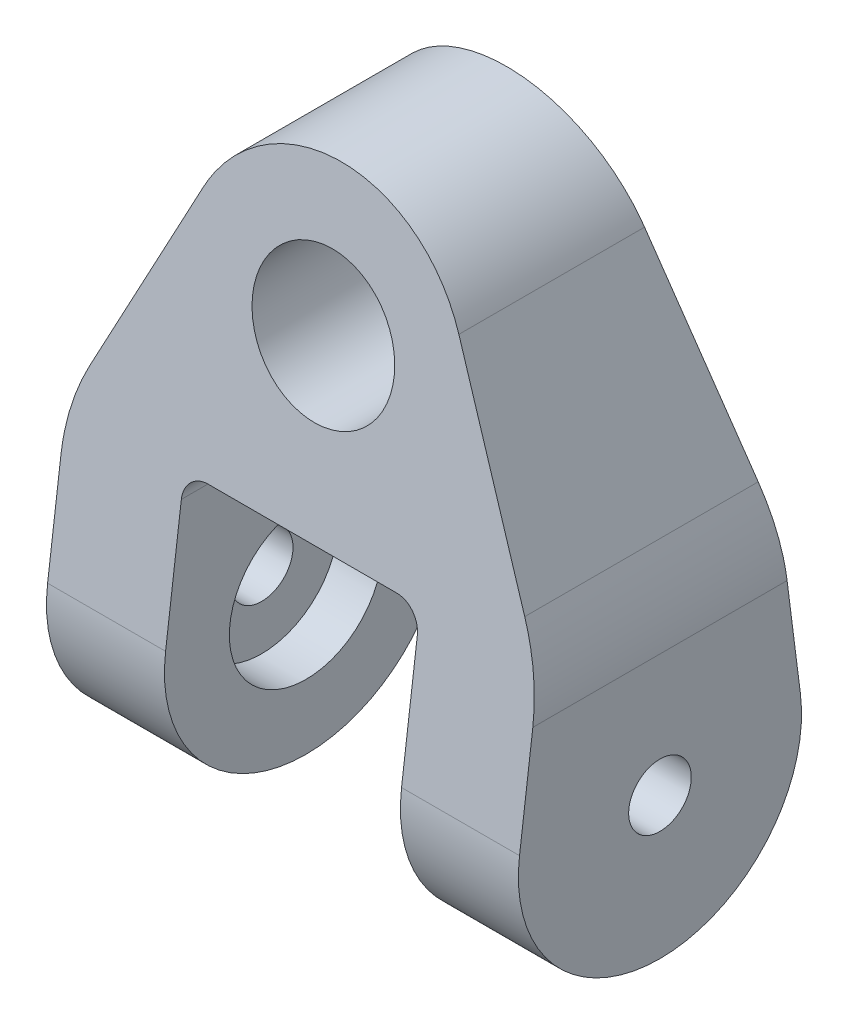
ISO-10303-21;
HEADER;
FILE_DESCRIPTION(('STEP AP214'),'2;1');
FILE_NAME('part.step','',(''),(''),'','','');
FILE_SCHEMA(('AUTOMOTIVE_DESIGN { 1 0 10303 214 1 1 1 1 }'));
ENDSEC;
DATA;
#1=APPLICATION_CONTEXT('core data for automotive mechanical design processes');
#2=APPLICATION_PROTOCOL_DEFINITION('international standard','automotive_design',2000,#1);
#3=PRODUCT_CONTEXT('',#1,'mechanical');
#4=PRODUCT('Part','Part','',(#3));
#5=PRODUCT_RELATED_PRODUCT_CATEGORY('part','',(#4));
#6=PRODUCT_DEFINITION_FORMATION('','',#4);
#7=PRODUCT_DEFINITION_CONTEXT('part definition',#1,'design');
#8=PRODUCT_DEFINITION('design','',#6,#7);
#9=PRODUCT_DEFINITION_SHAPE('','',#8);
#10=(LENGTH_UNIT() NAMED_UNIT(*) SI_UNIT(.MILLI.,.METRE.));
#11=(NAMED_UNIT(*) PLANE_ANGLE_UNIT() SI_UNIT($,.RADIAN.));
#12=(NAMED_UNIT(*) SI_UNIT($,.STERADIAN.) SOLID_ANGLE_UNIT());
#13=UNCERTAINTY_MEASURE_WITH_UNIT(LENGTH_MEASURE(1.E-05),#10,'distance_accuracy_value','');
#14=(GEOMETRIC_REPRESENTATION_CONTEXT(3) GLOBAL_UNCERTAINTY_ASSIGNED_CONTEXT((#13)) GLOBAL_UNIT_ASSIGNED_CONTEXT((#10,
#11,#12)) REPRESENTATION_CONTEXT('',''));
#15=CARTESIAN_POINT('',(0.,0.,0.));
#16=DIRECTION('',(0.,0.,1.));
#17=DIRECTION('',(1.,0.,0.));
#18=AXIS2_PLACEMENT_3D('',#15,#16,#17);
#19=CARTESIAN_POINT('',(0.,0.,19.05));
#20=DIRECTION('',(0.,0.,-1.));
#21=DIRECTION('',(-1.,0.,0.));
#22=AXIS2_PLACEMENT_3D('',#19,#20,#21);
#23=CYLINDRICAL_SURFACE('',#22,9.525);
#24=CARTESIAN_POINT('',(0.,0.,-13.539961345954));
#25=DIRECTION('',(0.,0.126403695343971,-0.991978883748736));
#26=DIRECTION('',(0.,-0.991978883748736,-0.126403695343971));
#27=AXIS2_PLACEMENT_3D('',#24,#25,#26);
#28=ELLIPSE('',#27,9.60201890992333,9.525);
#29=CARTESIAN_POINT('',(0.,-9.525,-14.753692018931));
#30=VERTEX_POINT('',#29);
#31=EDGE_CURVE('E183',#30,#30,#28,.T.);
#32=ORIENTED_EDGE('',*,*,#31,.T.);
#33=EDGE_LOOP('',(#32));
#34=FACE_BOUND('',#33,.T.);
#35=CARTESIAN_POINT('',(0.,0.,13.539961345954));
#36=DIRECTION('',(0.,0.126403695343971,0.991978883748736));
#37=DIRECTION('',(0.,0.991978883748736,-0.126403695343971));
#38=AXIS2_PLACEMENT_3D('',#35,#36,#37);
#39=ELLIPSE('',#38,9.60201890992333,9.525);
#40=CARTESIAN_POINT('',(0.,9.525,12.326230672977));
#41=VERTEX_POINT('',#40);
#42=EDGE_CURVE('E199',#41,#41,#39,.T.);
#43=ORIENTED_EDGE('',*,*,#42,.T.);
#44=EDGE_LOOP('',(#43));
#45=FACE_BOUND('',#44,.T.);
#46=ADVANCED_FACE('F46',(#34,#45),#23,.F.);
#47=CARTESIAN_POINT('',(-31.75,-44.45,0.));
#48=DIRECTION('',(1.,0.,0.));
#49=DIRECTION('',(0.,0.,-1.));
#50=AXIS2_PLACEMENT_3D('',#47,#48,#49);
#51=CYLINDRICAL_SURFACE('',#50,19.05);
#52=DIRECTION('',(1.,0.,0.));
#53=VECTOR('',#52,1.);
#54=CARTESIAN_POINT('',(-31.75,-42.0420096036973,18.8971977354134));
#55=LINE('',#54,#53);
#56=CARTESIAN_POINT('',(-31.75,-42.0420096036973,18.8971977354134));
#57=VERTEX_POINT('',#56);
#58=CARTESIAN_POINT('',(-15.875,-42.0420096036973,18.8971977354134));
#59=VERTEX_POINT('',#58);
#60=EDGE_CURVE('E153',#57,#59,#55,.T.);
#61=ORIENTED_EDGE('',*,*,#60,.F.);
#62=CARTESIAN_POINT('',(-31.75,-44.45,0.));
#63=DIRECTION('',(1.,0.,0.));
#64=DIRECTION('',(0.,0.,-1.));
#65=AXIS2_PLACEMENT_3D('',#62,#63,#64);
#66=CIRCLE('',#65,19.05);
#67=CARTESIAN_POINT('',(-31.75,-42.0420096036973,-18.8971977354134));
#68=VERTEX_POINT('',#67);
#69=EDGE_CURVE('E147',#57,#68,#66,.T.);
#70=ORIENTED_EDGE('',*,*,#69,.T.);
#71=DIRECTION('',(1.,0.,0.));
#72=VECTOR('',#71,1.);
#73=CARTESIAN_POINT('',(-31.75,-42.0420096036973,-18.8971977354134));
#74=LINE('',#73,#72);
#75=CARTESIAN_POINT('',(-15.875,-42.0420096036973,-18.8971977354134));
#76=VERTEX_POINT('',#75);
#77=EDGE_CURVE('E150',#68,#76,#74,.T.);
#78=ORIENTED_EDGE('',*,*,#77,.T.);
#79=CARTESIAN_POINT('',(-15.875,-44.45,0.));
#80=DIRECTION('',(-1.,0.,0.));
#81=DIRECTION('',(0.,0.,1.));
#82=AXIS2_PLACEMENT_3D('',#79,#80,#81);
#83=CIRCLE('',#82,19.05);
#84=EDGE_CURVE('E217',#76,#59,#83,.T.);
#85=ORIENTED_EDGE('',*,*,#84,.T.);
#86=EDGE_LOOP('',(#61,#70,#78,#85));
#87=FACE_BOUND('',#86,.T.);
#88=ADVANCED_FACE('F149',(#87),#51,.T.);
#89=CARTESIAN_POINT('',(15.875,-44.45,0.));
#90=DIRECTION('',(1.,0.,0.));
#91=DIRECTION('',(0.,0.,-1.));
#92=AXIS2_PLACEMENT_3D('',#89,#90,#91);
#93=CIRCLE('',#92,19.05);
#94=CARTESIAN_POINT('',(15.875,-42.0420096036973,18.8971977354134));
#95=VERTEX_POINT('',#94);
#96=CARTESIAN_POINT('',(15.875,-42.0420096036973,-18.8971977354134));
#97=VERTEX_POINT('',#96);
#98=EDGE_CURVE('E215',#95,#97,#93,.T.);
#99=ORIENTED_EDGE('',*,*,#98,.T.);
#100=CARTESIAN_POINT('',(31.75,-42.0420096036973,-18.8971977354134));
#101=VERTEX_POINT('',#100);
#102=EDGE_CURVE('E166',#97,#101,#74,.T.);
#103=ORIENTED_EDGE('',*,*,#102,.T.);
#104=CARTESIAN_POINT('',(31.75,-44.45,0.));
#105=DIRECTION('',(1.,0.,0.));
#106=DIRECTION('',(0.,0.,-1.));
#107=AXIS2_PLACEMENT_3D('',#104,#105,#106);
#108=CIRCLE('',#107,19.05);
#109=CARTESIAN_POINT('',(31.75,-42.0420096036973,18.8971977354134));
#110=VERTEX_POINT('',#109);
#111=EDGE_CURVE('E177',#110,#101,#108,.T.);
#112=ORIENTED_EDGE('',*,*,#111,.F.);
#113=EDGE_CURVE('E165',#95,#110,#55,.T.);
#114=ORIENTED_EDGE('',*,*,#113,.F.);
#115=EDGE_LOOP('',(#99,#103,#112,#114));
#116=FACE_BOUND('',#115,.T.);
#117=ADVANCED_FACE('F294',(#116),#51,.T.);
#118=CARTESIAN_POINT('',(-31.75,-42.0420096036973,18.8971977354134));
#119=DIRECTION('',(0.,0.126403695343971,0.991978883748736));
#120=DIRECTION('',(0.,-0.991978883748736,0.126403695343971));
#121=AXIS2_PLACEMENT_3D('',#118,#119,#120);
#122=PLANE('',#121);
#123=ORIENTED_EDGE('',*,*,#42,.F.);
#124=EDGE_LOOP('',(#123));
#125=FACE_BOUND('',#124,.T.);
#126=DIRECTION('',(-0.428730230966541,-0.896186021635441,0.11419721397923));
#127=VECTOR('',#126,1.);
#128=CARTESIAN_POINT('',(-17.5058243717781,7.54997308494896,12.5779000427148));
#129=LINE('',#128,#127);
#130=CARTESIAN_POINT('',(-17.1847647256924,8.22109246527484,12.4923821238559));
#131=VERTEX_POINT('',#130);
#132=CARTESIAN_POINT('',(-29.2630196342565,-17.0263998573498,15.7095638401521));
#133=VERTEX_POINT('',#132);
#134=EDGE_CURVE('E204',#131,#133,#129,.T.);
#135=ORIENTED_EDGE('',*,*,#134,.T.);
#136=CARTESIAN_POINT('',(-6.35,-27.9878564777162,17.1063361362828));
#137=DIRECTION('',(0.,0.126403695343971,0.991978883748736));
#138=DIRECTION('',(0.,0.991978883748736,-0.126403695343971));
#139=AXIS2_PLACEMENT_3D('',#136,#137,#138);
#140=ELLIPSE('',#139,25.6053837597955,25.4);
#141=CARTESIAN_POINT('',(-31.75,-27.9878564777162,17.1063361362828));
#142=VERTEX_POINT('',#141);
#143=EDGE_CURVE('E255',#133,#142,#140,.T.);
#144=ORIENTED_EDGE('',*,*,#143,.T.);
#145=DIRECTION('',(0.,-0.991978883748736,0.126403695343971));
#146=VECTOR('',#145,1.);
#147=CARTESIAN_POINT('',(-31.75,-42.0420096036973,18.8971977354134));
#148=LINE('',#147,#146);
#149=EDGE_CURVE('E172',#142,#57,#148,.T.);
#150=ORIENTED_EDGE('',*,*,#149,.T.);
#151=ORIENTED_EDGE('',*,*,#60,.T.);
#152=DIRECTION('',(0.,0.991978883748736,-0.126403695343971));
#153=VECTOR('',#152,1.);
#154=CARTESIAN_POINT('',(-15.875,-63.1763063446539,21.5902522452608));
#155=LINE('',#154,#153);
#156=CARTESIAN_POINT('',(-15.875,-25.4,16.7765764738927));
#157=VERTEX_POINT('',#156);
#158=EDGE_CURVE('E212',#59,#157,#155,.T.);
#159=ORIENTED_EDGE('',*,*,#158,.T.);
#160=CARTESIAN_POINT('',(-12.7,-25.4,16.7765764738927));
#161=DIRECTION('',(0.,0.126403695343971,0.991978883748736));
#162=DIRECTION('',(0.,-0.991978883748736,0.126403695343971));
#163=AXIS2_PLACEMENT_3D('',#160,#161,#162);
#164=ELLIPSE('',#163,3.20067296997444,3.175);
#165=CARTESIAN_POINT('',(-12.7,-22.225,16.3719995829003));
#166=VERTEX_POINT('',#165);
#167=EDGE_CURVE('E241',#157,#166,#164,.F.);
#168=ORIENTED_EDGE('',*,*,#167,.T.);
#169=DIRECTION('',(1.,0.,0.));
#170=VECTOR('',#169,1.);
#171=CARTESIAN_POINT('',(15.875,-22.225,16.3719995829003));
#172=LINE('',#171,#170);
#173=CARTESIAN_POINT('',(12.7,-22.225,16.3719995829003));
#174=VERTEX_POINT('',#173);
#175=EDGE_CURVE('E209',#166,#174,#172,.T.);
#176=ORIENTED_EDGE('',*,*,#175,.T.);
#177=CARTESIAN_POINT('',(12.7,-25.4,16.7765764738927));
#178=DIRECTION('',(0.,0.126403695343971,0.991978883748736));
#179=DIRECTION('',(0.,-0.991978883748736,0.126403695343971));
#180=AXIS2_PLACEMENT_3D('',#177,#178,#179);
#181=ELLIPSE('',#180,3.20067296997444,3.175);
#182=CARTESIAN_POINT('',(15.875,-25.4,16.7765764738927));
#183=VERTEX_POINT('',#182);
#184=EDGE_CURVE('E245',#174,#183,#181,.F.);
#185=ORIENTED_EDGE('',*,*,#184,.T.);
#186=DIRECTION('',(0.,-0.991978883748736,0.126403695343971));
#187=VECTOR('',#186,1.);
#188=CARTESIAN_POINT('',(15.875,-63.1763063446539,21.5902522452608));
#189=LINE('',#188,#187);
#190=EDGE_CURVE('E207',#183,#95,#189,.T.);
#191=ORIENTED_EDGE('',*,*,#190,.T.);
#192=ORIENTED_EDGE('',*,*,#113,.T.);
#193=DIRECTION('',(0.,-0.991978883748736,0.126403695343971));
#194=VECTOR('',#193,1.);
#195=CARTESIAN_POINT('',(31.75,-42.0420096036973,18.8971977354134));
#196=LINE('',#195,#194);
#197=CARTESIAN_POINT('',(31.75,-27.9878564777163,17.1063361362828));
#198=VERTEX_POINT('',#197);
#199=EDGE_CURVE('E158',#198,#110,#196,.T.);
#200=ORIENTED_EDGE('',*,*,#199,.F.);
#201=CARTESIAN_POINT('',(6.35,-27.9878564777163,17.1063361362828));
#202=DIRECTION('',(0.,0.126403695343971,0.991978883748736));
#203=DIRECTION('',(0.,0.991978883748736,-0.126403695343971));
#204=AXIS2_PLACEMENT_3D('',#201,#202,#203);
#205=ELLIPSE('',#204,25.6053837597955,25.4);
#206=CARTESIAN_POINT('',(29.2630196342565,-17.0263998573498,15.7095638401521));
#207=VERTEX_POINT('',#206);
#208=EDGE_CURVE('E61',#198,#207,#205,.T.);
#209=ORIENTED_EDGE('',*,*,#208,.T.);
#210=DIRECTION('',(-0.428730230966541,0.896186021635441,-0.11419721397923));
#211=VECTOR('',#210,1.);
#212=CARTESIAN_POINT('',(17.5058243717781,7.54997308494896,12.5779000427148));
#213=LINE('',#212,#211);
#214=CARTESIAN_POINT('',(17.1847647256924,8.22109246527484,12.4923821238559));
#215=VERTEX_POINT('',#214);
#216=EDGE_CURVE('E200',#207,#215,#213,.T.);
#217=ORIENTED_EDGE('',*,*,#216,.T.);
#218=CARTESIAN_POINT('',(0.,0.,13.539961345954));
#219=DIRECTION('',(0.,0.126403695343971,0.991978883748736));
#220=DIRECTION('',(0.,0.991978883748736,-0.126403695343971));
#221=AXIS2_PLACEMENT_3D('',#218,#219,#220);
#222=ELLIPSE('',#221,19.2040378198467,19.05);
#223=EDGE_CURVE('E202',#215,#131,#222,.T.);
#224=ORIENTED_EDGE('',*,*,#223,.T.);
#225=EDGE_LOOP('',(#135,#144,#150,#151,#159,#168,#176,#185,#191,#192,#200,#209,#217,#224));
#226=FACE_BOUND('',#225,.T.);
#227=ADVANCED_FACE('F275',(#125,#226),#122,.T.);
#228=CARTESIAN_POINT('',(-31.75,-42.0420096036973,-18.8971977354134));
#229=DIRECTION('',(0.,0.126403695343971,-0.991978883748736));
#230=DIRECTION('',(0.,0.991978883748736,0.126403695343971));
#231=AXIS2_PLACEMENT_3D('',#228,#229,#230);
#232=PLANE('',#231);
#233=ORIENTED_EDGE('',*,*,#31,.F.);
#234=EDGE_LOOP('',(#233));
#235=FACE_BOUND('',#234,.T.);
#236=DIRECTION('',(0.,0.991978883748736,0.126403695343971));
#237=VECTOR('',#236,1.);
#238=CARTESIAN_POINT('',(-31.75,-42.0420096036973,-18.8971977354134));
#239=LINE('',#238,#237);
#240=CARTESIAN_POINT('',(-31.75,-27.9878564777163,-17.1063361362828));
#241=VERTEX_POINT('',#240);
#242=EDGE_CURVE('E157',#68,#241,#239,.T.);
#243=ORIENTED_EDGE('',*,*,#242,.T.);
#244=CARTESIAN_POINT('',(-6.35,-27.9878564777162,-17.1063361362828));
#245=DIRECTION('',(0.,0.126403695343971,-0.991978883748736));
#246=DIRECTION('',(0.,-0.991978883748736,-0.126403695343971));
#247=AXIS2_PLACEMENT_3D('',#244,#245,#246);
#248=ELLIPSE('',#247,25.6053837597955,25.4);
#249=CARTESIAN_POINT('',(-29.2630196342565,-17.0263998573498,-15.7095638401521));
#250=VERTEX_POINT('',#249);
#251=EDGE_CURVE('E250',#241,#250,#248,.T.);
#252=ORIENTED_EDGE('',*,*,#251,.T.);
#253=DIRECTION('',(0.428730230966541,0.896186021635441,0.11419721397923));
#254=VECTOR('',#253,1.);
#255=CARTESIAN_POINT('',(-15.6404560708337,11.4492012609968,-12.0810378024833));
#256=LINE('',#255,#254);
#257=CARTESIAN_POINT('',(-17.1847647256924,8.22109246527484,-12.4923821238559));
#258=VERTEX_POINT('',#257);
#259=EDGE_CURVE('E190',#250,#258,#256,.T.);
#260=ORIENTED_EDGE('',*,*,#259,.T.);
#261=CARTESIAN_POINT('',(0.,0.,-13.539961345954));
#262=DIRECTION('',(0.,0.126403695343971,-0.991978883748736));
#263=DIRECTION('',(0.,-0.991978883748736,-0.126403695343971));
#264=AXIS2_PLACEMENT_3D('',#261,#262,#263);
#265=ELLIPSE('',#264,19.2040378198467,19.05);
#266=CARTESIAN_POINT('',(17.1847647256924,8.22109246527484,-12.4923821238559));
#267=VERTEX_POINT('',#266);
#268=EDGE_CURVE('E188',#258,#267,#265,.T.);
#269=ORIENTED_EDGE('',*,*,#268,.T.);
#270=DIRECTION('',(0.428730230966541,-0.896186021635441,-0.11419721397923));
#271=VECTOR('',#270,1.);
#272=CARTESIAN_POINT('',(15.6404560708337,11.4492012609968,-12.0810378024833));
#273=LINE('',#272,#271);
#274=CARTESIAN_POINT('',(29.2630196342565,-17.0263998573498,-15.7095638401521));
#275=VERTEX_POINT('',#274);
#276=EDGE_CURVE('E185',#267,#275,#273,.T.);
#277=ORIENTED_EDGE('',*,*,#276,.T.);
#278=CARTESIAN_POINT('',(6.35,-27.9878564777163,-17.1063361362828));
#279=DIRECTION('',(0.,0.126403695343971,-0.991978883748736));
#280=DIRECTION('',(0.,-0.991978883748736,-0.126403695343971));
#281=AXIS2_PLACEMENT_3D('',#278,#279,#280);
#282=ELLIPSE('',#281,25.6053837597955,25.4);
#283=CARTESIAN_POINT('',(31.75,-27.9878564777163,-17.1063361362828));
#284=VERTEX_POINT('',#283);
#285=EDGE_CURVE('E248',#275,#284,#282,.T.);
#286=ORIENTED_EDGE('',*,*,#285,.T.);
#287=DIRECTION('',(0.,0.991978883748736,0.126403695343971));
#288=VECTOR('',#287,1.);
#289=CARTESIAN_POINT('',(31.75,-42.0420096036973,-18.8971977354134));
#290=LINE('',#289,#288);
#291=EDGE_CURVE('E179',#101,#284,#290,.T.);
#292=ORIENTED_EDGE('',*,*,#291,.F.);
#293=ORIENTED_EDGE('',*,*,#102,.F.);
#294=DIRECTION('',(0.,0.991978883748736,0.126403695343971));
#295=VECTOR('',#294,1.);
#296=CARTESIAN_POINT('',(15.875,-58.3989550938499,-20.98149447637));
#297=LINE('',#296,#295);
#298=CARTESIAN_POINT('',(15.875,-25.4,-16.7765764738927));
#299=VERTEX_POINT('',#298);
#300=EDGE_CURVE('E192',#97,#299,#297,.T.);
#301=ORIENTED_EDGE('',*,*,#300,.T.);
#302=CARTESIAN_POINT('',(12.7,-25.4,-16.7765764738927));
#303=DIRECTION('',(0.,0.126403695343971,-0.991978883748736));
#304=DIRECTION('',(0.,0.991978883748736,0.126403695343971));
#305=AXIS2_PLACEMENT_3D('',#302,#303,#304);
#306=ELLIPSE('',#305,3.20067296997444,3.175);
#307=CARTESIAN_POINT('',(12.7,-22.225,-16.3719995829003));
#308=VERTEX_POINT('',#307);
#309=EDGE_CURVE('E243',#299,#308,#306,.F.);
#310=ORIENTED_EDGE('',*,*,#309,.T.);
#311=DIRECTION('',(-1.,0.,0.));
#312=VECTOR('',#311,1.);
#313=CARTESIAN_POINT('',(15.875,-22.225,-16.3719995829003));
#314=LINE('',#313,#312);
#315=CARTESIAN_POINT('',(-12.7,-22.225,-16.3719995829003));
#316=VERTEX_POINT('',#315);
#317=EDGE_CURVE('E195',#308,#316,#314,.T.);
#318=ORIENTED_EDGE('',*,*,#317,.T.);
#319=CARTESIAN_POINT('',(-12.7,-25.4,-16.7765764738927));
#320=DIRECTION('',(0.,0.126403695343971,-0.991978883748736));
#321=DIRECTION('',(0.,0.991978883748736,0.126403695343971));
#322=AXIS2_PLACEMENT_3D('',#319,#320,#321);
#323=ELLIPSE('',#322,3.20067296997444,3.175);
#324=CARTESIAN_POINT('',(-15.875,-25.4,-16.7765764738927));
#325=VERTEX_POINT('',#324);
#326=EDGE_CURVE('E239',#316,#325,#323,.F.);
#327=ORIENTED_EDGE('',*,*,#326,.T.);
#328=DIRECTION('',(0.,-0.991978883748736,-0.126403695343971));
#329=VECTOR('',#328,1.);
#330=CARTESIAN_POINT('',(-15.875,-58.3989550938499,-20.98149447637));
#331=LINE('',#330,#329);
#332=EDGE_CURVE('E164',#325,#76,#331,.T.);
#333=ORIENTED_EDGE('',*,*,#332,.T.);
#334=ORIENTED_EDGE('',*,*,#77,.F.);
#335=EDGE_LOOP('',(#243,#252,#260,#269,#277,#286,#292,#293,#301,#310,#318,#327,#333,#334));
#336=FACE_BOUND('',#335,.T.);
#337=ADVANCED_FACE('F162',(#235,#336),#232,.T.);
#338=CARTESIAN_POINT('',(-31.75,-22.225,19.05));
#339=DIRECTION('',(1.,0.,0.));
#340=DIRECTION('',(0.,0.,-1.));
#341=AXIS2_PLACEMENT_3D('',#338,#339,#340);
#342=PLANE('',#341);
#343=CARTESIAN_POINT('',(-31.75,-44.45,0.));
#344=DIRECTION('',(1.,0.,0.));
#345=DIRECTION('',(0.,0.,-1.));
#346=AXIS2_PLACEMENT_3D('',#343,#344,#345);
#347=CIRCLE('',#346,4.21639999999999);
#348=CARTESIAN_POINT('',(-31.75,-44.45,-4.2164));
#349=VERTEX_POINT('',#348);
#350=EDGE_CURVE('E180',#349,#349,#347,.T.);
#351=ORIENTED_EDGE('',*,*,#350,.T.);
#352=EDGE_LOOP('',(#351));
#353=FACE_BOUND('',#352,.T.);
#354=ORIENTED_EDGE('',*,*,#149,.F.);
#355=DIRECTION('',(0.,0.,-1.));
#356=VECTOR('',#355,1.);
#357=CARTESIAN_POINT('',(-31.75,-27.9878564777162,19.05));
#358=LINE('',#357,#356);
#359=EDGE_CURVE('E171',#142,#241,#358,.T.);
#360=ORIENTED_EDGE('',*,*,#359,.T.);
#361=ORIENTED_EDGE('',*,*,#242,.F.);
#362=ORIENTED_EDGE('',*,*,#69,.F.);
#363=EDGE_LOOP('',(#354,#360,#361,#362));
#364=FACE_BOUND('',#363,.T.);
#365=ADVANCED_FACE('F169',(#353,#364),#342,.F.);
#366=CARTESIAN_POINT('',(-17.1847647256924,8.22109246527484,19.05));
#367=DIRECTION('',(0.902087387175453,-0.431553410250648,0.));
#368=DIRECTION('',(0.431553410250648,0.902087387175453,0.));
#369=AXIS2_PLACEMENT_3D('',#366,#367,#368);
#370=PLANE('',#369);
#371=ORIENTED_EDGE('',*,*,#259,.F.);
#372=DIRECTION('',(0.,0.,-1.));
#373=VECTOR('',#372,1.);
#374=CARTESIAN_POINT('',(-29.2630196342565,-17.0263998573498,19.05));
#375=LINE('',#374,#373);
#376=EDGE_CURVE('E252',#250,#133,#375,.F.);
#377=ORIENTED_EDGE('',*,*,#376,.T.);
#378=ORIENTED_EDGE('',*,*,#134,.F.);
#379=DIRECTION('',(0.,0.,-1.));
#380=VECTOR('',#379,1.);
#381=CARTESIAN_POINT('',(-17.1847647256924,8.22109246527484,19.05));
#382=LINE('',#381,#380);
#383=EDGE_CURVE('E222',#131,#258,#382,.T.);
#384=ORIENTED_EDGE('',*,*,#383,.T.);
#385=EDGE_LOOP('',(#371,#377,#378,#384));
#386=FACE_BOUND('',#385,.T.);
#387=ADVANCED_FACE('F272',(#386),#370,.F.);
#388=CARTESIAN_POINT('',(17.1847647256924,8.22109246527484,19.05));
#389=DIRECTION('',(-0.902087387175453,-0.431553410250648,0.));
#390=DIRECTION('',(0.431553410250648,-0.902087387175453,0.));
#391=AXIS2_PLACEMENT_3D('',#388,#389,#390);
#392=PLANE('',#391);
#393=ORIENTED_EDGE('',*,*,#216,.F.);
#394=DIRECTION('',(0.,0.,-1.));
#395=VECTOR('',#394,1.);
#396=CARTESIAN_POINT('',(29.2630196342565,-17.0263998573498,19.05));
#397=LINE('',#396,#395);
#398=EDGE_CURVE('E54',#207,#275,#397,.T.);
#399=ORIENTED_EDGE('',*,*,#398,.T.);
#400=ORIENTED_EDGE('',*,*,#276,.F.);
#401=DIRECTION('',(0.,0.,-1.));
#402=VECTOR('',#401,1.);
#403=CARTESIAN_POINT('',(17.1847647256924,8.22109246527484,19.05));
#404=LINE('',#403,#402);
#405=EDGE_CURVE('E219',#215,#267,#404,.T.);
#406=ORIENTED_EDGE('',*,*,#405,.F.);
#407=EDGE_LOOP('',(#393,#399,#400,#406));
#408=FACE_BOUND('',#407,.T.);
#409=ADVANCED_FACE('F260',(#408),#392,.F.);
#410=CARTESIAN_POINT('',(31.75,-22.225,19.05));
#411=DIRECTION('',(-1.,0.,0.));
#412=DIRECTION('',(0.,0.,1.));
#413=AXIS2_PLACEMENT_3D('',#410,#411,#412);
#414=PLANE('',#413);
#415=CARTESIAN_POINT('',(31.75,-44.45,0.));
#416=DIRECTION('',(-1.,0.,0.));
#417=DIRECTION('',(0.,0.,1.));
#418=AXIS2_PLACEMENT_3D('',#415,#416,#417);
#419=CIRCLE('',#418,4.21639999999999);
#420=CARTESIAN_POINT('',(31.75,-44.45,4.21639999999999));
#421=VERTEX_POINT('',#420);
#422=EDGE_CURVE('E397',#421,#421,#419,.T.);
#423=ORIENTED_EDGE('',*,*,#422,.T.);
#424=EDGE_LOOP('',(#423));
#425=FACE_BOUND('',#424,.T.);
#426=ORIENTED_EDGE('',*,*,#291,.T.);
#427=DIRECTION('',(0.,0.,-1.));
#428=VECTOR('',#427,1.);
#429=CARTESIAN_POINT('',(31.75,-27.9878564777163,19.05));
#430=LINE('',#429,#428);
#431=EDGE_CURVE('E14',#284,#198,#430,.F.);
#432=ORIENTED_EDGE('',*,*,#431,.T.);
#433=ORIENTED_EDGE('',*,*,#199,.T.);
#434=ORIENTED_EDGE('',*,*,#111,.T.);
#435=EDGE_LOOP('',(#426,#432,#433,#434));
#436=FACE_BOUND('',#435,.T.);
#437=ADVANCED_FACE('F301',(#425,#436),#414,.F.);
#438=CARTESIAN_POINT('',(0.,0.,19.05));
#439=DIRECTION('',(0.,0.,-1.));
#440=DIRECTION('',(-1.,0.,0.));
#441=AXIS2_PLACEMENT_3D('',#438,#439,#440);
#442=CYLINDRICAL_SURFACE('',#441,19.05);
#443=ORIENTED_EDGE('',*,*,#223,.F.);
#444=ORIENTED_EDGE('',*,*,#405,.T.);
#445=ORIENTED_EDGE('',*,*,#268,.F.);
#446=ORIENTED_EDGE('',*,*,#383,.F.);
#447=EDGE_LOOP('',(#443,#444,#445,#446));
#448=FACE_BOUND('',#447,.T.);
#449=ADVANCED_FACE('F269',(#448),#442,.T.);
#450=CARTESIAN_POINT('',(-15.875,-63.5,19.05));
#451=DIRECTION('',(-1.,0.,0.));
#452=DIRECTION('',(0.,0.,1.));
#453=AXIS2_PLACEMENT_3D('',#450,#451,#452);
#454=PLANE('',#453);
#455=CARTESIAN_POINT('',(-15.875,-44.45,0.));
#456=DIRECTION('',(1.,0.,0.));
#457=DIRECTION('',(0.,0.,-1.));
#458=AXIS2_PLACEMENT_3D('',#455,#456,#457);
#459=CIRCLE('',#458,10.31875);
#460=CARTESIAN_POINT('',(-15.875,-44.45,-10.31875));
#461=VERTEX_POINT('',#460);
#462=EDGE_CURVE('E400',#461,#461,#459,.T.);
#463=ORIENTED_EDGE('',*,*,#462,.F.);
#464=EDGE_LOOP('',(#463));
#465=FACE_BOUND('',#464,.T.);
#466=ORIENTED_EDGE('',*,*,#332,.F.);
#467=DIRECTION('',(0.,0.,-1.));
#468=VECTOR('',#467,1.);
#469=CARTESIAN_POINT('',(-15.875,-25.4,16.3719995829003));
#470=LINE('',#469,#468);
#471=EDGE_CURVE('E234',#325,#157,#470,.F.);
#472=ORIENTED_EDGE('',*,*,#471,.T.);
#473=ORIENTED_EDGE('',*,*,#158,.F.);
#474=ORIENTED_EDGE('',*,*,#84,.F.);
#475=EDGE_LOOP('',(#466,#472,#473,#474));
#476=FACE_BOUND('',#475,.T.);
#477=ADVANCED_FACE('F312',(#465,#476),#454,.F.);
#478=CARTESIAN_POINT('',(15.875,-22.225,19.05));
#479=DIRECTION('',(0.,1.,0.));
#480=DIRECTION('',(-1.,0.,0.));
#481=AXIS2_PLACEMENT_3D('',#478,#479,#480);
#482=PLANE('',#481);
#483=ORIENTED_EDGE('',*,*,#175,.F.);
#484=DIRECTION('',(0.,0.,-1.));
#485=VECTOR('',#484,1.);
#486=CARTESIAN_POINT('',(-12.7,-22.225,-16.3719995829003));
#487=LINE('',#486,#485);
#488=EDGE_CURVE('E231',#166,#316,#487,.T.);
#489=ORIENTED_EDGE('',*,*,#488,.T.);
#490=ORIENTED_EDGE('',*,*,#317,.F.);
#491=DIRECTION('',(0.,0.,-1.));
#492=VECTOR('',#491,1.);
#493=CARTESIAN_POINT('',(12.7,-22.225,16.3719995829003));
#494=LINE('',#493,#492);
#495=EDGE_CURVE('E225',#308,#174,#494,.F.);
#496=ORIENTED_EDGE('',*,*,#495,.T.);
#497=EDGE_LOOP('',(#483,#489,#490,#496));
#498=FACE_BOUND('',#497,.T.);
#499=ADVANCED_FACE('F308',(#498),#482,.F.);
#500=CARTESIAN_POINT('',(15.875,-63.5,19.05));
#501=DIRECTION('',(1.,0.,0.));
#502=DIRECTION('',(0.,0.,-1.));
#503=AXIS2_PLACEMENT_3D('',#500,#501,#502);
#504=PLANE('',#503);
#505=CARTESIAN_POINT('',(15.875,-44.45,0.));
#506=DIRECTION('',(-1.,0.,0.));
#507=DIRECTION('',(0.,0.,1.));
#508=AXIS2_PLACEMENT_3D('',#505,#506,#507);
#509=CIRCLE('',#508,10.31875);
#510=CARTESIAN_POINT('',(15.875,-44.45,10.31875));
#511=VERTEX_POINT('',#510);
#512=EDGE_CURVE('E390',#511,#511,#509,.T.);
#513=ORIENTED_EDGE('',*,*,#512,.F.);
#514=EDGE_LOOP('',(#513));
#515=FACE_BOUND('',#514,.T.);
#516=ORIENTED_EDGE('',*,*,#190,.F.);
#517=DIRECTION('',(0.,0.,-1.));
#518=VECTOR('',#517,1.);
#519=CARTESIAN_POINT('',(15.875,-25.4,-16.3719995829003));
#520=LINE('',#519,#518);
#521=EDGE_CURVE('E236',#183,#299,#520,.T.);
#522=ORIENTED_EDGE('',*,*,#521,.T.);
#523=ORIENTED_EDGE('',*,*,#300,.F.);
#524=ORIENTED_EDGE('',*,*,#98,.F.);
#525=EDGE_LOOP('',(#516,#522,#523,#524));
#526=FACE_BOUND('',#525,.T.);
#527=ADVANCED_FACE('F305',(#515,#526),#504,.F.);
#528=CARTESIAN_POINT('',(-12.7,-25.4,19.05));
#529=DIRECTION('',(0.,0.,1.));
#530=DIRECTION('',(1.,0.,0.));
#531=AXIS2_PLACEMENT_3D('',#528,#529,#530);
#532=CYLINDRICAL_SURFACE('',#531,3.175);
#533=ORIENTED_EDGE('',*,*,#167,.F.);
#534=ORIENTED_EDGE('',*,*,#471,.F.);
#535=ORIENTED_EDGE('',*,*,#326,.F.);
#536=ORIENTED_EDGE('',*,*,#488,.F.);
#537=EDGE_LOOP('',(#533,#534,#535,#536));
#538=FACE_BOUND('',#537,.T.);
#539=ADVANCED_FACE('F285',(#538),#532,.F.);
#540=CARTESIAN_POINT('',(12.7,-25.4,19.05));
#541=DIRECTION('',(0.,0.,1.));
#542=DIRECTION('',(1.,0.,0.));
#543=AXIS2_PLACEMENT_3D('',#540,#541,#542);
#544=CYLINDRICAL_SURFACE('',#543,3.175);
#545=ORIENTED_EDGE('',*,*,#184,.F.);
#546=ORIENTED_EDGE('',*,*,#495,.F.);
#547=ORIENTED_EDGE('',*,*,#309,.F.);
#548=ORIENTED_EDGE('',*,*,#521,.F.);
#549=EDGE_LOOP('',(#545,#546,#547,#548));
#550=FACE_BOUND('',#549,.T.);
#551=ADVANCED_FACE('F279',(#550),#544,.F.);
#552=CARTESIAN_POINT('',(-6.35,-27.9878564777162,19.05));
#553=DIRECTION('',(0.,0.,-1.));
#554=DIRECTION('',(-1.,0.,0.));
#555=AXIS2_PLACEMENT_3D('',#552,#553,#554);
#556=CYLINDRICAL_SURFACE('',#555,25.4);
#557=ORIENTED_EDGE('',*,*,#143,.F.);
#558=ORIENTED_EDGE('',*,*,#376,.F.);
#559=ORIENTED_EDGE('',*,*,#251,.F.);
#560=ORIENTED_EDGE('',*,*,#359,.F.);
#561=EDGE_LOOP('',(#557,#558,#559,#560));
#562=FACE_BOUND('',#561,.T.);
#563=ADVANCED_FACE('F277',(#562),#556,.T.);
#564=CARTESIAN_POINT('',(6.35,-27.9878564777163,19.05));
#565=DIRECTION('',(0.,0.,-1.));
#566=DIRECTION('',(-1.,0.,0.));
#567=AXIS2_PLACEMENT_3D('',#564,#565,#566);
#568=CYLINDRICAL_SURFACE('',#567,25.4);
#569=ORIENTED_EDGE('',*,*,#208,.F.);
#570=ORIENTED_EDGE('',*,*,#431,.F.);
#571=ORIENTED_EDGE('',*,*,#285,.F.);
#572=ORIENTED_EDGE('',*,*,#398,.F.);
#573=EDGE_LOOP('',(#569,#570,#571,#572));
#574=FACE_BOUND('',#573,.T.);
#575=ADVANCED_FACE('F48',(#574),#568,.T.);
#576=CARTESIAN_POINT('',(-15.875,-44.45,0.));
#577=DIRECTION('',(1.,0.,0.));
#578=DIRECTION('',(0.,0.,-1.));
#579=AXIS2_PLACEMENT_3D('',#576,#577,#578);
#580=CYLINDRICAL_SURFACE('',#579,4.21639999999999);
#581=ORIENTED_EDGE('',*,*,#350,.F.);
#582=EDGE_LOOP('',(#581));
#583=FACE_BOUND('',#582,.T.);
#584=CARTESIAN_POINT('',(-21.844,-44.45,0.));
#585=DIRECTION('',(1.,0.,0.));
#586=DIRECTION('',(0.,0.,-1.));
#587=AXIS2_PLACEMENT_3D('',#584,#585,#586);
#588=CIRCLE('',#587,4.21639999999999);
#589=CARTESIAN_POINT('',(-21.844,-44.45,-4.2164));
#590=VERTEX_POINT('',#589);
#591=EDGE_CURVE('E406',#590,#590,#588,.T.);
#592=ORIENTED_EDGE('',*,*,#591,.T.);
#593=EDGE_LOOP('',(#592));
#594=FACE_BOUND('',#593,.T.);
#595=ADVANCED_FACE('F284',(#583,#594),#580,.F.);
#596=CARTESIAN_POINT('',(-21.844,-40.2336,0.));
#597=DIRECTION('',(-1.,0.,0.));
#598=DIRECTION('',(0.,0.,1.));
#599=AXIS2_PLACEMENT_3D('',#596,#597,#598);
#600=PLANE('',#599);
#601=ORIENTED_EDGE('',*,*,#591,.F.);
#602=EDGE_LOOP('',(#601));
#603=FACE_BOUND('',#602,.T.);
#604=CARTESIAN_POINT('',(-21.844,-44.45,0.));
#605=DIRECTION('',(1.,0.,0.));
#606=DIRECTION('',(0.,0.,-1.));
#607=AXIS2_PLACEMENT_3D('',#604,#605,#606);
#608=CIRCLE('',#607,10.31875);
#609=CARTESIAN_POINT('',(-21.844,-44.45,-10.31875));
#610=VERTEX_POINT('',#609);
#611=EDGE_CURVE('E403',#610,#610,#608,.T.);
#612=ORIENTED_EDGE('',*,*,#611,.T.);
#613=EDGE_LOOP('',(#612));
#614=FACE_BOUND('',#613,.T.);
#615=ADVANCED_FACE('F362',(#603,#614),#600,.F.);
#616=CARTESIAN_POINT('',(-15.875,-44.45,0.));
#617=DIRECTION('',(1.,0.,0.));
#618=DIRECTION('',(0.,0.,-1.));
#619=AXIS2_PLACEMENT_3D('',#616,#617,#618);
#620=CYLINDRICAL_SURFACE('',#619,10.31875);
#621=ORIENTED_EDGE('',*,*,#611,.F.);
#622=EDGE_LOOP('',(#621));
#623=FACE_BOUND('',#622,.T.);
#624=ORIENTED_EDGE('',*,*,#462,.T.);
#625=EDGE_LOOP('',(#624));
#626=FACE_BOUND('',#625,.T.);
#627=ADVANCED_FACE('F366',(#623,#626),#620,.F.);
#628=CARTESIAN_POINT('',(15.875,-44.45,0.));
#629=DIRECTION('',(-1.,0.,0.));
#630=DIRECTION('',(0.,0.,1.));
#631=AXIS2_PLACEMENT_3D('',#628,#629,#630);
#632=CYLINDRICAL_SURFACE('',#631,4.21639999999999);
#633=ORIENTED_EDGE('',*,*,#422,.F.);
#634=EDGE_LOOP('',(#633));
#635=FACE_BOUND('',#634,.T.);
#636=CARTESIAN_POINT('',(21.844,-44.45,0.));
#637=DIRECTION('',(-1.,0.,0.));
#638=DIRECTION('',(0.,0.,1.));
#639=AXIS2_PLACEMENT_3D('',#636,#637,#638);
#640=CIRCLE('',#639,4.21639999999999);
#641=CARTESIAN_POINT('',(21.844,-44.45,4.21639999999999));
#642=VERTEX_POINT('',#641);
#643=EDGE_CURVE('E392',#642,#642,#640,.T.);
#644=ORIENTED_EDGE('',*,*,#643,.T.);
#645=EDGE_LOOP('',(#644));
#646=FACE_BOUND('',#645,.T.);
#647=ADVANCED_FACE('F370',(#635,#646),#632,.F.);
#648=CARTESIAN_POINT('',(21.844,-40.2336,0.));
#649=DIRECTION('',(1.,0.,0.));
#650=DIRECTION('',(0.,0.,-1.));
#651=AXIS2_PLACEMENT_3D('',#648,#649,#650);
#652=PLANE('',#651);
#653=ORIENTED_EDGE('',*,*,#643,.F.);
#654=EDGE_LOOP('',(#653));
#655=FACE_BOUND('',#654,.T.);
#656=CARTESIAN_POINT('',(21.844,-44.45,0.));
#657=DIRECTION('',(-1.,0.,0.));
#658=DIRECTION('',(0.,0.,1.));
#659=AXIS2_PLACEMENT_3D('',#656,#657,#658);
#660=CIRCLE('',#659,10.31875);
#661=CARTESIAN_POINT('',(21.844,-44.45,10.31875));
#662=VERTEX_POINT('',#661);
#663=EDGE_CURVE('E387',#662,#662,#660,.T.);
#664=ORIENTED_EDGE('',*,*,#663,.T.);
#665=EDGE_LOOP('',(#664));
#666=FACE_BOUND('',#665,.T.);
#667=ADVANCED_FACE('F374',(#655,#666),#652,.F.);
#668=CARTESIAN_POINT('',(15.875,-44.45,0.));
#669=DIRECTION('',(-1.,0.,0.));
#670=DIRECTION('',(0.,0.,1.));
#671=AXIS2_PLACEMENT_3D('',#668,#669,#670);
#672=CYLINDRICAL_SURFACE('',#671,10.31875);
#673=ORIENTED_EDGE('',*,*,#663,.F.);
#674=EDGE_LOOP('',(#673));
#675=FACE_BOUND('',#674,.T.);
#676=ORIENTED_EDGE('',*,*,#512,.T.);
#677=EDGE_LOOP('',(#676));
#678=FACE_BOUND('',#677,.T.);
#679=ADVANCED_FACE('F378',(#675,#678),#672,.F.);
#680=CLOSED_SHELL('',(#46,#88,#117,#227,#337,#365,#387,#409,#437,#449,#477,#499,#527,#539,#551,
#563,#575,#595,#615,#627,#647,#667,#679));
#681=MANIFOLD_SOLID_BREP('B2',#680);
#682=ADVANCED_BREP_SHAPE_REPRESENTATION('',(#18,#681),#14);
#683=SHAPE_DEFINITION_REPRESENTATION(#9,#682);
ENDSEC;
END-ISO-10303-21;
